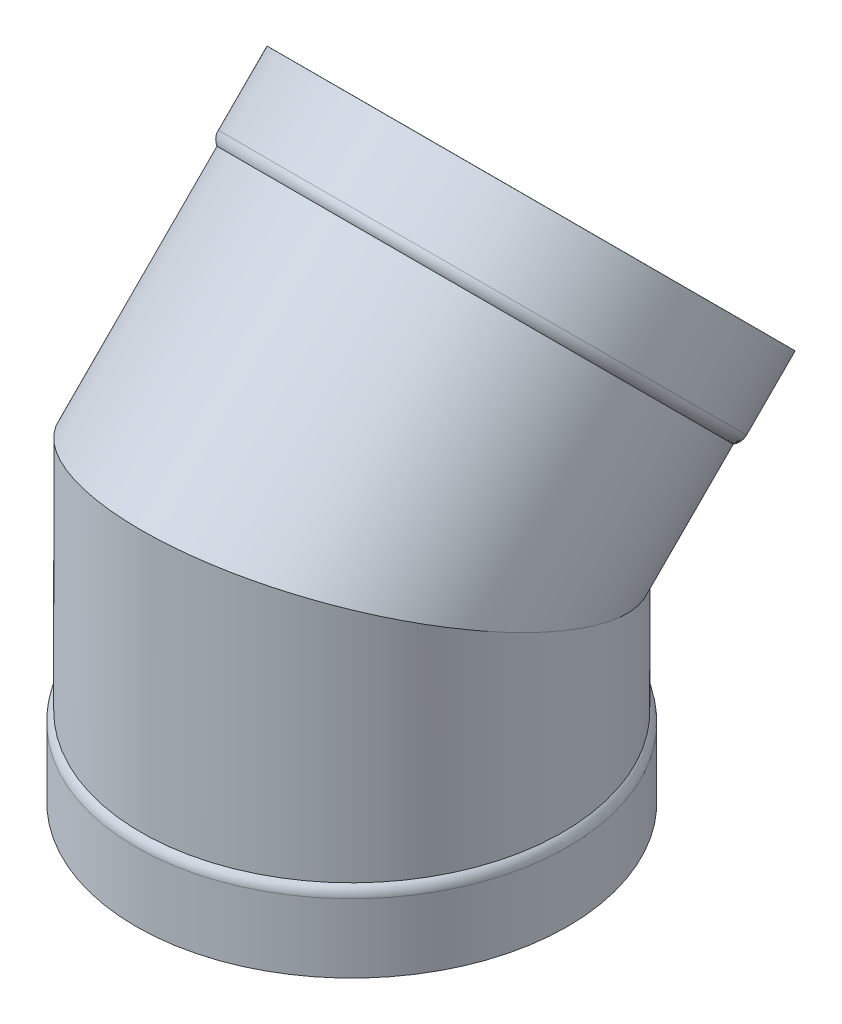
ISO-10303-21;
HEADER;
FILE_DESCRIPTION(('STEP AP214'),'2;1');
FILE_NAME('part.step','',(''),(''),'','','');
FILE_SCHEMA(('AUTOMOTIVE_DESIGN { 1 0 10303 214 1 1 1 1 }'));
ENDSEC;
DATA;
#1=APPLICATION_CONTEXT('core data for automotive mechanical design processes');
#2=APPLICATION_PROTOCOL_DEFINITION('international standard','automotive_design',2000,#1);
#3=PRODUCT_CONTEXT('',#1,'mechanical');
#4=PRODUCT('Part','Part','',(#3));
#5=PRODUCT_RELATED_PRODUCT_CATEGORY('part','',(#4));
#6=PRODUCT_DEFINITION_FORMATION('','',#4);
#7=PRODUCT_DEFINITION_CONTEXT('part definition',#1,'design');
#8=PRODUCT_DEFINITION('design','',#6,#7);
#9=PRODUCT_DEFINITION_SHAPE('','',#8);
#10=(LENGTH_UNIT() NAMED_UNIT(*) SI_UNIT(.MILLI.,.METRE.));
#11=(NAMED_UNIT(*) PLANE_ANGLE_UNIT() SI_UNIT($,.RADIAN.));
#12=(NAMED_UNIT(*) SI_UNIT($,.STERADIAN.) SOLID_ANGLE_UNIT());
#13=UNCERTAINTY_MEASURE_WITH_UNIT(LENGTH_MEASURE(1.E-05),#10,'distance_accuracy_value','');
#14=(GEOMETRIC_REPRESENTATION_CONTEXT(3) GLOBAL_UNCERTAINTY_ASSIGNED_CONTEXT((#13)) GLOBAL_UNIT_ASSIGNED_CONTEXT((#10,
#11,#12)) REPRESENTATION_CONTEXT('',''));
#15=CARTESIAN_POINT('',(0.,0.,0.));
#16=DIRECTION('',(0.,0.,1.));
#17=DIRECTION('',(1.,0.,0.));
#18=AXIS2_PLACEMENT_3D('',#15,#16,#17);
#19=CARTESIAN_POINT('',(0.,-52.1137931034483,0.));
#20=DIRECTION('',(0.,-1.,0.));
#21=DIRECTION('',(0.,0.,-1.));
#22=AXIS2_PLACEMENT_3D('',#19,#20,#21);
#23=CYLINDRICAL_SURFACE('',#22,203.2);
#24=CARTESIAN_POINT('',(0.,76.2,0.));
#25=DIRECTION('',(0.,-1.,0.));
#26=DIRECTION('',(0.,0.,-1.));
#27=AXIS2_PLACEMENT_3D('',#24,#25,#26);
#28=CIRCLE('',#27,203.2);
#29=CARTESIAN_POINT('',(0.,76.2,-203.2));
#30=VERTEX_POINT('',#29);
#31=EDGE_CURVE('E64',#30,#30,#28,.T.);
#32=ORIENTED_EDGE('',*,*,#31,.F.);
#33=EDGE_LOOP('',(#32));
#34=FACE_BOUND('',#33,.T.);
#35=CARTESIAN_POINT('',(0.,244.475,0.));
#36=DIRECTION('',(0.,-0.923928870591096,0.382564297979126));
#37=DIRECTION('',(0.,-0.382564297979126,-0.923928870591096));
#38=AXIS2_PLACEMENT_3D('',#35,#36,#37);
#39=ELLIPSE('',#38,219.930350125329,203.2);
#40=CARTESIAN_POINT('',(0.,160.3375,-203.2));
#41=VERTEX_POINT('',#40);
#42=EDGE_CURVE('E85',#41,#41,#39,.T.);
#43=ORIENTED_EDGE('',*,*,#42,.T.);
#44=EDGE_LOOP('',(#43));
#45=FACE_BOUND('',#44,.T.);
#46=ADVANCED_FACE('F38',(#34,#45),#23,.T.);
#47=CARTESIAN_POINT('',(0.,-52.1137931034483,0.));
#48=DIRECTION('',(0.,-1.,0.));
#49=DIRECTION('',(0.,0.,-1.));
#50=AXIS2_PLACEMENT_3D('',#47,#48,#49);
#51=CYLINDRICAL_SURFACE('',#50,207.9625);
#52=CARTESIAN_POINT('',(0.,66.2860656775425,0.));
#53=DIRECTION('',(0.,1.,0.));
#54=DIRECTION('',(0.,0.,1.));
#55=AXIS2_PLACEMENT_3D('',#52,#53,#54);
#56=CIRCLE('',#55,207.9625);
#57=CARTESIAN_POINT('',(0.,66.2860656775425,207.9625));
#58=VERTEX_POINT('',#57);
#59=EDGE_CURVE('E52',#58,#58,#56,.F.);
#60=ORIENTED_EDGE('',*,*,#59,.T.);
#61=EDGE_LOOP('',(#60));
#62=FACE_BOUND('',#61,.T.);
#63=CARTESIAN_POINT('',(0.,0.,0.));
#64=DIRECTION('',(0.,-1.,0.));
#65=DIRECTION('',(0.,0.,-1.));
#66=AXIS2_PLACEMENT_3D('',#63,#64,#65);
#67=CIRCLE('',#66,207.9625);
#68=CARTESIAN_POINT('',(0.,0.,-207.9625));
#69=VERTEX_POINT('',#68);
#70=EDGE_CURVE('E68',#69,#69,#67,.T.);
#71=ORIENTED_EDGE('',*,*,#70,.F.);
#72=EDGE_LOOP('',(#71));
#73=FACE_BOUND('',#72,.T.);
#74=ADVANCED_FACE('F124',(#62,#73),#51,.T.);
#75=CARTESIAN_POINT('',(0.,0.,207.9625));
#76=DIRECTION('',(0.,1.,0.));
#77=DIRECTION('',(0.,0.,1.));
#78=AXIS2_PLACEMENT_3D('',#75,#76,#77);
#79=PLANE('',#78);
#80=CARTESIAN_POINT('',(0.,0.,0.));
#81=DIRECTION('',(0.,-1.,0.));
#82=DIRECTION('',(0.,0.,-1.));
#83=AXIS2_PLACEMENT_3D('',#80,#81,#82);
#84=CIRCLE('',#83,203.2);
#85=CARTESIAN_POINT('',(0.,0.,-203.2));
#86=VERTEX_POINT('',#85);
#87=EDGE_CURVE('E72',#86,#86,#84,.T.);
#88=ORIENTED_EDGE('',*,*,#87,.F.);
#89=EDGE_LOOP('',(#88));
#90=FACE_BOUND('',#89,.T.);
#91=ORIENTED_EDGE('',*,*,#70,.T.);
#92=EDGE_LOOP('',(#91));
#93=FACE_BOUND('',#92,.T.);
#94=ADVANCED_FACE('F130',(#90,#93),#79,.F.);
#95=CARTESIAN_POINT('',(0.,-52.1137931034483,0.));
#96=DIRECTION('',(0.,-1.,0.));
#97=DIRECTION('',(0.,0.,-1.));
#98=AXIS2_PLACEMENT_3D('',#95,#96,#97);
#99=CYLINDRICAL_SURFACE('',#98,203.2);
#100=CARTESIAN_POINT('',(0.,61.5235656775425,0.));
#101=DIRECTION('',(0.,1.,0.));
#102=DIRECTION('',(0.,0.,1.));
#103=AXIS2_PLACEMENT_3D('',#100,#101,#102);
#104=CIRCLE('',#103,203.2);
#105=CARTESIAN_POINT('',(0.,61.5235656775425,203.2));
#106=VERTEX_POINT('',#105);
#107=EDGE_CURVE('E46',#106,#106,#104,.T.);
#108=ORIENTED_EDGE('',*,*,#107,.T.);
#109=EDGE_LOOP('',(#108));
#110=FACE_BOUND('',#109,.T.);
#111=ORIENTED_EDGE('',*,*,#87,.T.);
#112=EDGE_LOOP('',(#111));
#113=FACE_BOUND('',#112,.T.);
#114=ADVANCED_FACE('F120',(#110,#113),#99,.F.);
#115=CARTESIAN_POINT('',(0.,-52.1137931034483,0.));
#116=DIRECTION('',(0.,-1.,0.));
#117=DIRECTION('',(0.,0.,-1.));
#118=AXIS2_PLACEMENT_3D('',#115,#116,#117);
#119=CYLINDRICAL_SURFACE('',#118,198.4375);
#120=CARTESIAN_POINT('',(0.,244.475,0.));
#121=DIRECTION('',(0.,-0.923928870591096,0.382564297979126));
#122=DIRECTION('',(0.,-0.382564297979126,-0.923928870591096));
#123=AXIS2_PLACEMENT_3D('',#120,#121,#122);
#124=ELLIPSE('',#123,214.775732544267,198.4375);
#125=CARTESIAN_POINT('',(0.,162.30947265625,-198.4375));
#126=VERTEX_POINT('',#125);
#127=EDGE_CURVE('E81',#126,#126,#124,.F.);
#128=ORIENTED_EDGE('',*,*,#127,.T.);
#129=EDGE_LOOP('',(#128));
#130=FACE_BOUND('',#129,.T.);
#131=CARTESIAN_POINT('',(0.,71.4375,0.));
#132=DIRECTION('',(0.,-1.,0.));
#133=DIRECTION('',(0.,0.,-1.));
#134=AXIS2_PLACEMENT_3D('',#131,#132,#133);
#135=CIRCLE('',#134,198.4375);
#136=CARTESIAN_POINT('',(0.,71.4375,-198.4375));
#137=VERTEX_POINT('',#136);
#138=EDGE_CURVE('E76',#137,#137,#135,.T.);
#139=ORIENTED_EDGE('',*,*,#138,.T.);
#140=EDGE_LOOP('',(#139));
#141=FACE_BOUND('',#140,.T.);
#142=ADVANCED_FACE('F110',(#130,#141),#119,.F.);
#143=CARTESIAN_POINT('',(0.,454.24902523729,-209.665854469212));
#144=DIRECTION('',(0.,0.707289115823478,-0.706924399520659));
#145=DIRECTION('',(0.,-0.706924399520659,-0.707289115823477));
#146=AXIS2_PLACEMENT_3D('',#143,#144,#145);
#147=CYLINDRICAL_SURFACE('',#146,203.2);
#148=CARTESIAN_POINT('',(0.,363.494075965196,-118.957703329339));
#149=DIRECTION('',(0.,-0.707289115823478,0.706924399520659));
#150=DIRECTION('',(0.,-0.706924399520659,-0.707289115823477));
#151=AXIS2_PLACEMENT_3D('',#148,#149,#150);
#152=CIRCLE('',#151,203.2);
#153=CARTESIAN_POINT('',(0.,219.847037982598,-262.678851664669));
#154=VERTEX_POINT('',#153);
#155=EDGE_CURVE('E80',#154,#154,#152,.T.);
#156=ORIENTED_EDGE('',*,*,#155,.T.);
#157=EDGE_LOOP('',(#156));
#158=FACE_BOUND('',#157,.T.);
#159=ORIENTED_EDGE('',*,*,#42,.F.);
#160=EDGE_LOOP('',(#159));
#161=FACE_BOUND('',#160,.T.);
#162=ADVANCED_FACE('F107',(#158,#161),#147,.T.);
#163=CARTESIAN_POINT('',(0.,454.24902523729,-209.665854469212));
#164=DIRECTION('',(0.,0.707289115823478,-0.706924399520659));
#165=DIRECTION('',(0.,-0.706924399520659,-0.707289115823477));
#166=AXIS2_PLACEMENT_3D('',#163,#164,#165);
#167=CYLINDRICAL_SURFACE('',#166,207.9625);
#168=CARTESIAN_POINT('',(0.,370.506093806458,-125.966105397129));
#169=DIRECTION('',(0.,-0.707289115823478,0.706924399520659));
#170=DIRECTION('',(0.,-0.706924399520659,-0.707289115823478));
#171=AXIS2_PLACEMENT_3D('',#168,#169,#170);
#172=CIRCLE('',#171,207.9625);
#173=CARTESIAN_POINT('',(0.,223.492328371144,-273.055718146569));
#174=VERTEX_POINT('',#173);
#175=EDGE_CURVE('E58',#174,#174,#172,.F.);
#176=ORIENTED_EDGE('',*,*,#175,.T.);
#177=EDGE_LOOP('',(#176));
#178=FACE_BOUND('',#177,.T.);
#179=CARTESIAN_POINT('',(0.,417.389506590945,-172.825342572813));
#180=DIRECTION('',(0.,-0.707289115823478,0.706924399520659));
#181=DIRECTION('',(0.,-0.706924399520659,-0.707289115823477));
#182=AXIS2_PLACEMENT_3D('',#179,#180,#181);
#183=CIRCLE('',#182,207.9625);
#184=CARTESIAN_POINT('',(0.,270.37574115563,-319.914955322253));
#185=VERTEX_POINT('',#184);
#186=EDGE_CURVE('E89',#185,#185,#183,.T.);
#187=ORIENTED_EDGE('',*,*,#186,.T.);
#188=EDGE_LOOP('',(#187));
#189=FACE_BOUND('',#188,.T.);
#190=ADVANCED_FACE('F109',(#178,#189),#167,.T.);
#191=CARTESIAN_POINT('',(0.,564.40327202626,-25.735729823373));
#192=DIRECTION('',(0.,-0.707289115823478,0.706924399520659));
#193=DIRECTION('',(0.,0.706924399520659,0.707289115823477));
#194=AXIS2_PLACEMENT_3D('',#191,#192,#193);
#195=PLANE('',#194);
#196=CARTESIAN_POINT('',(0.,417.389506590945,-172.825342572813));
#197=DIRECTION('',(0.,-0.707289115823478,0.706924399520659));
#198=DIRECTION('',(0.,-0.706924399520659,-0.707289115823477));
#199=AXIS2_PLACEMENT_3D('',#196,#197,#198);
#200=CIRCLE('',#199,203.2);
#201=CARTESIAN_POINT('',(0.,273.742468608347,-316.546490908144));
#202=VERTEX_POINT('',#201);
#203=EDGE_CURVE('E93',#202,#202,#200,.T.);
#204=ORIENTED_EDGE('',*,*,#203,.T.);
#205=EDGE_LOOP('',(#204));
#206=FACE_BOUND('',#205,.T.);
#207=ORIENTED_EDGE('',*,*,#186,.F.);
#208=EDGE_LOOP('',(#207));
#209=FACE_BOUND('',#208,.T.);
#210=ADVANCED_FACE('F117',(#206,#209),#195,.F.);
#211=CARTESIAN_POINT('',(0.,454.24902523729,-209.665854469212));
#212=DIRECTION('',(0.,0.707289115823478,-0.706924399520659));
#213=DIRECTION('',(0.,-0.706924399520659,-0.707289115823477));
#214=AXIS2_PLACEMENT_3D('',#211,#212,#213);
#215=CYLINDRICAL_SURFACE('',#214,203.2);
#216=CARTESIAN_POINT('',(0.,373.874558220568,-129.332832849846));
#217=DIRECTION('',(0.,-0.707289115823478,0.706924399520659));
#218=DIRECTION('',(0.,-0.706924399520659,-0.707289115823478));
#219=AXIS2_PLACEMENT_3D('',#216,#217,#218);
#220=CIRCLE('',#219,203.2);
#221=CARTESIAN_POINT('',(0.,230.22752023797,-273.053981185177));
#222=VERTEX_POINT('',#221);
#223=EDGE_CURVE('E10',#222,#222,#220,.T.);
#224=ORIENTED_EDGE('',*,*,#223,.T.);
#225=EDGE_LOOP('',(#224));
#226=FACE_BOUND('',#225,.T.);
#227=ORIENTED_EDGE('',*,*,#203,.F.);
#228=EDGE_LOOP('',(#227));
#229=FACE_BOUND('',#228,.T.);
#230=ADVANCED_FACE('F160',(#226,#229),#215,.F.);
#231=CARTESIAN_POINT('',(0.,454.24902523729,-209.665854469212));
#232=DIRECTION('',(0.,0.707289115823478,-0.706924399520659));
#233=DIRECTION('',(0.,-0.706924399520659,-0.707289115823477));
#234=AXIS2_PLACEMENT_3D('',#231,#232,#233);
#235=CYLINDRICAL_SURFACE('',#234,198.4375);
#236=ORIENTED_EDGE('',*,*,#127,.F.);
#237=EDGE_LOOP('',(#236));
#238=FACE_BOUND('',#237,.T.);
#239=CARTESIAN_POINT('',(0.,366.862540379305,-122.324430782056));
#240=DIRECTION('',(0.,-0.707289115823478,0.706924399520659));
#241=DIRECTION('',(0.,-0.706924399520659,-0.707289115823477));
#242=AXIS2_PLACEMENT_3D('',#239,#240,#241);
#243=CIRCLE('',#242,198.4375);
#244=CARTESIAN_POINT('',(0.,226.582229849424,-262.677114703277));
#245=VERTEX_POINT('',#244);
#246=EDGE_CURVE('E97',#245,#245,#243,.T.);
#247=ORIENTED_EDGE('',*,*,#246,.F.);
#248=EDGE_LOOP('',(#247));
#249=FACE_BOUND('',#248,.T.);
#250=ADVANCED_FACE('F140',(#238,#249),#235,.F.);
#251=CARTESIAN_POINT('',(0.,370.506093806459,-125.966105397129));
#252=DIRECTION('',(0.,-0.707289115823478,0.706924399520659));
#253=DIRECTION('',(0.,-0.706924399520659,-0.707289115823478));
#254=AXIS2_PLACEMENT_3D('',#251,#252,#253);
#255=TOROIDAL_SURFACE('',#254,195.2625,12.7);
#256=ORIENTED_EDGE('',*,*,#175,.F.);
#257=EDGE_LOOP('',(#256));
#258=FACE_BOUND('',#257,.T.);
#259=ORIENTED_EDGE('',*,*,#155,.F.);
#260=EDGE_LOOP('',(#259));
#261=FACE_BOUND('',#260,.T.);
#262=ADVANCED_FACE('F136',(#258,#261),#255,.T.);
#263=CARTESIAN_POINT('',(0.,66.2860656775425,0.));
#264=DIRECTION('',(0.,1.,0.));
#265=DIRECTION('',(0.,0.,1.));
#266=AXIS2_PLACEMENT_3D('',#263,#264,#265);
#267=TOROIDAL_SURFACE('',#266,195.2625,12.7);
#268=ORIENTED_EDGE('',*,*,#31,.T.);
#269=EDGE_LOOP('',(#268));
#270=FACE_BOUND('',#269,.T.);
#271=ORIENTED_EDGE('',*,*,#59,.F.);
#272=EDGE_LOOP('',(#271));
#273=FACE_BOUND('',#272,.T.);
#274=ADVANCED_FACE('F139',(#270,#273),#267,.T.);
#275=CARTESIAN_POINT('',(0.,61.5235656775425,0.));
#276=DIRECTION('',(0.,1.,0.));
#277=DIRECTION('',(0.,0.,1.));
#278=AXIS2_PLACEMENT_3D('',#275,#276,#277);
#279=TOROIDAL_SURFACE('',#278,190.5,12.7);
#280=ORIENTED_EDGE('',*,*,#107,.F.);
#281=EDGE_LOOP('',(#280));
#282=FACE_BOUND('',#281,.T.);
#283=ORIENTED_EDGE('',*,*,#138,.F.);
#284=EDGE_LOOP('',(#283));
#285=FACE_BOUND('',#284,.T.);
#286=ADVANCED_FACE('F143',(#282,#285),#279,.F.);
#287=CARTESIAN_POINT('',(0.,373.874558220568,-129.332832849846));
#288=DIRECTION('',(0.,-0.707289115823478,0.706924399520659));
#289=DIRECTION('',(0.,-0.706924399520659,-0.707289115823478));
#290=AXIS2_PLACEMENT_3D('',#287,#288,#289);
#291=TOROIDAL_SURFACE('',#290,190.5,12.7);
#292=ORIENTED_EDGE('',*,*,#246,.T.);
#293=EDGE_LOOP('',(#292));
#294=FACE_BOUND('',#293,.T.);
#295=ORIENTED_EDGE('',*,*,#223,.F.);
#296=EDGE_LOOP('',(#295));
#297=FACE_BOUND('',#296,.T.);
#298=ADVANCED_FACE('F40',(#294,#297),#291,.F.);
#299=CLOSED_SHELL('',(#46,#74,#94,#114,#142,#162,#190,#210,#230,#250,#262,#274,#286,#298));
#300=MANIFOLD_SOLID_BREP('B2',#299);
#301=ADVANCED_BREP_SHAPE_REPRESENTATION('',(#18,#300),#14);
#302=SHAPE_DEFINITION_REPRESENTATION(#9,#301);
ENDSEC;
END-ISO-10303-21;
